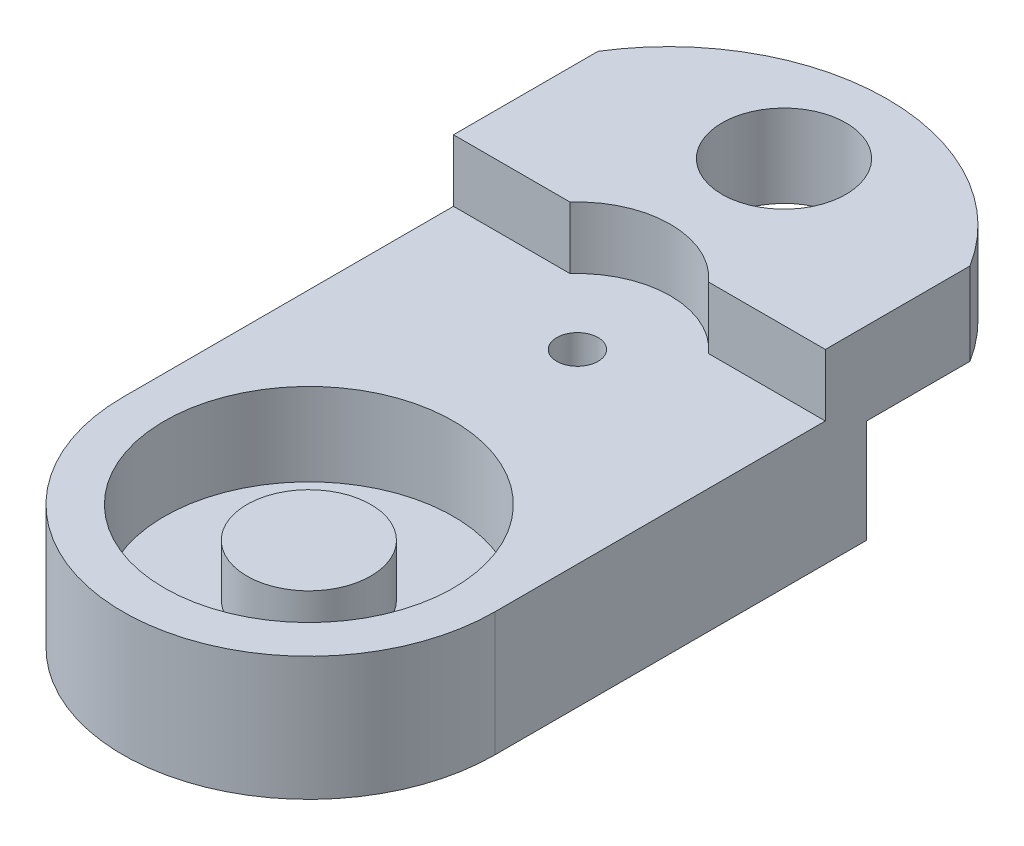
ISO-10303-21;
HEADER;
FILE_DESCRIPTION(('STEP AP214'),'2;1');
FILE_NAME('part.step','',(''),(''),'','','');
FILE_SCHEMA(('AUTOMOTIVE_DESIGN { 1 0 10303 214 1 1 1 1 }'));
ENDSEC;
DATA;
#1=APPLICATION_CONTEXT('core data for automotive mechanical design processes');
#2=APPLICATION_PROTOCOL_DEFINITION('international standard','automotive_design',2000,#1);
#3=PRODUCT_CONTEXT('',#1,'mechanical');
#4=PRODUCT('Part','Part','',(#3));
#5=PRODUCT_RELATED_PRODUCT_CATEGORY('part','',(#4));
#6=PRODUCT_DEFINITION_FORMATION('','',#4);
#7=PRODUCT_DEFINITION_CONTEXT('part definition',#1,'design');
#8=PRODUCT_DEFINITION('design','',#6,#7);
#9=PRODUCT_DEFINITION_SHAPE('','',#8);
#10=(LENGTH_UNIT() NAMED_UNIT(*) SI_UNIT(.MILLI.,.METRE.));
#11=(NAMED_UNIT(*) PLANE_ANGLE_UNIT() SI_UNIT($,.RADIAN.));
#12=(NAMED_UNIT(*) SI_UNIT($,.STERADIAN.) SOLID_ANGLE_UNIT());
#13=UNCERTAINTY_MEASURE_WITH_UNIT(LENGTH_MEASURE(1.E-05),#10,'distance_accuracy_value','');
#14=(GEOMETRIC_REPRESENTATION_CONTEXT(3) GLOBAL_UNCERTAINTY_ASSIGNED_CONTEXT((#13)) GLOBAL_UNIT_ASSIGNED_CONTEXT((#10,
#11,#12)) REPRESENTATION_CONTEXT('',''));
#15=CARTESIAN_POINT('',(0.,0.,0.));
#16=DIRECTION('',(0.,0.,1.));
#17=DIRECTION('',(1.,0.,0.));
#18=AXIS2_PLACEMENT_3D('',#15,#16,#17);
#19=CARTESIAN_POINT('',(-3.,7.,-41.504881108845));
#20=DIRECTION('',(0.,1.,0.));
#21=DIRECTION('',(0.,0.,1.));
#22=AXIS2_PLACEMENT_3D('',#19,#20,#21);
#23=PLANE('',#22);
#24=CARTESIAN_POINT('',(6.,7.,-46.504881108845));
#25=DIRECTION('',(0.,1.,0.));
#26=DIRECTION('',(0.,0.,1.));
#27=AXIS2_PLACEMENT_3D('',#24,#25,#26);
#28=CIRCLE('',#27,3.);
#29=CARTESIAN_POINT('',(6.,7.,-43.504881108845));
#30=VERTEX_POINT('',#29);
#31=EDGE_CURVE('E142',#30,#30,#28,.T.);
#32=ORIENTED_EDGE('',*,*,#31,.T.);
#33=EDGE_LOOP('',(#32));
#34=FACE_BOUND('',#33,.T.);
#35=DIRECTION('',(0.,0.,1.));
#36=VECTOR('',#35,1.);
#37=CARTESIAN_POINT('',(-3.,7.,-41.504881108845));
#38=LINE('',#37,#36);
#39=CARTESIAN_POINT('',(-3.,7.,-46.504881108845));
#40=VERTEX_POINT('',#39);
#41=CARTESIAN_POINT('',(-3.,7.,-41.504881108845));
#42=VERTEX_POINT('',#41);
#43=EDGE_CURVE('E123',#40,#42,#38,.T.);
#44=ORIENTED_EDGE('',*,*,#43,.F.);
#45=CARTESIAN_POINT('',(6.,7.,-40.904881108845));
#46=DIRECTION('',(0.,1.,0.));
#47=DIRECTION('',(0.,0.,1.));
#48=AXIS2_PLACEMENT_3D('',#45,#46,#47);
#49=CIRCLE('',#48,10.6);
#50=CARTESIAN_POINT('',(15.,7.,-46.504881108845));
#51=VERTEX_POINT('',#50);
#52=EDGE_CURVE('E37',#40,#51,#49,.F.);
#53=ORIENTED_EDGE('',*,*,#52,.T.);
#54=DIRECTION('',(0.,0.,1.));
#55=VECTOR('',#54,1.);
#56=CARTESIAN_POINT('',(15.,7.,-41.504881108845));
#57=LINE('',#56,#55);
#58=CARTESIAN_POINT('',(15.,7.,-41.504881108845));
#59=VERTEX_POINT('',#58);
#60=EDGE_CURVE('E124',#51,#59,#57,.T.);
#61=ORIENTED_EDGE('',*,*,#60,.T.);
#62=DIRECTION('',(1.,0.,0.));
#63=VECTOR('',#62,1.);
#64=CARTESIAN_POINT('',(-3.,7.,-41.504881108845));
#65=LINE('',#64,#63);
#66=EDGE_CURVE('E119',#42,#59,#65,.T.);
#67=ORIENTED_EDGE('',*,*,#66,.F.);
#68=EDGE_LOOP('',(#44,#53,#61,#67));
#69=FACE_BOUND('',#68,.T.);
#70=ADVANCED_FACE('F33',(#34,#69),#23,.F.);
#71=CARTESIAN_POINT('',(11.,11.,-39.504881108845));
#72=DIRECTION('',(0.,0.,-1.));
#73=DIRECTION('',(-1.,0.,0.));
#74=AXIS2_PLACEMENT_3D('',#71,#72,#73);
#75=PLANE('',#74);
#76=DIRECTION('',(0.,-1.,0.));
#77=VECTOR('',#76,1.);
#78=CARTESIAN_POINT('',(9.35410196624968,13.,-39.504881108845));
#79=LINE('',#78,#77);
#80=CARTESIAN_POINT('',(9.35410196624968,8.,-39.504881108845));
#81=VERTEX_POINT('',#80);
#82=CARTESIAN_POINT('',(9.35410196624968,11.,-39.504881108845));
#83=VERTEX_POINT('',#82);
#84=EDGE_CURVE('E210',#81,#83,#79,.F.);
#85=ORIENTED_EDGE('',*,*,#84,.F.);
#86=DIRECTION('',(1.,0.,0.));
#87=VECTOR('',#86,1.);
#88=CARTESIAN_POINT('',(11.,8.,-39.504881108845));
#89=LINE('',#88,#87);
#90=CARTESIAN_POINT('',(15.,8.,-39.504881108845));
#91=VERTEX_POINT('',#90);
#92=EDGE_CURVE('E157',#81,#91,#89,.T.);
#93=ORIENTED_EDGE('',*,*,#92,.T.);
#94=DIRECTION('',(0.,-1.,0.));
#95=VECTOR('',#94,1.);
#96=CARTESIAN_POINT('',(15.,11.,-39.504881108845));
#97=LINE('',#96,#95);
#98=CARTESIAN_POINT('',(15.,11.,-39.504881108845));
#99=VERTEX_POINT('',#98);
#100=EDGE_CURVE('E173',#99,#91,#97,.T.);
#101=ORIENTED_EDGE('',*,*,#100,.F.);
#102=DIRECTION('',(1.,0.,0.));
#103=VECTOR('',#102,1.);
#104=CARTESIAN_POINT('',(1.,11.,-39.504881108845));
#105=LINE('',#104,#103);
#106=EDGE_CURVE('E164',#83,#99,#105,.T.);
#107=ORIENTED_EDGE('',*,*,#106,.F.);
#108=EDGE_LOOP('',(#85,#93,#101,#107));
#109=FACE_BOUND('',#108,.T.);
#110=ADVANCED_FACE('F225',(#109),#75,.F.);
#111=DIRECTION('',(0.,-1.,0.));
#112=VECTOR('',#111,1.);
#113=CARTESIAN_POINT('',(2.64589803375032,13.,-39.504881108845));
#114=LINE('',#113,#112);
#115=CARTESIAN_POINT('',(2.64589803375032,11.,-39.504881108845));
#116=VERTEX_POINT('',#115);
#117=CARTESIAN_POINT('',(2.64589803375032,8.,-39.504881108845));
#118=VERTEX_POINT('',#117);
#119=EDGE_CURVE('E208',#116,#118,#114,.T.);
#120=ORIENTED_EDGE('',*,*,#119,.F.);
#121=CARTESIAN_POINT('',(-3.,11.,-39.504881108845));
#122=VERTEX_POINT('',#121);
#123=EDGE_CURVE('E165',#122,#116,#105,.T.);
#124=ORIENTED_EDGE('',*,*,#123,.F.);
#125=DIRECTION('',(0.,-1.,0.));
#126=VECTOR('',#125,1.);
#127=CARTESIAN_POINT('',(-3.,11.,-39.504881108845));
#128=LINE('',#127,#126);
#129=CARTESIAN_POINT('',(-3.,8.,-39.504881108845));
#130=VERTEX_POINT('',#129);
#131=EDGE_CURVE('E176',#122,#130,#128,.T.);
#132=ORIENTED_EDGE('',*,*,#131,.T.);
#133=EDGE_CURVE('E162',#130,#118,#89,.T.);
#134=ORIENTED_EDGE('',*,*,#133,.T.);
#135=EDGE_LOOP('',(#120,#124,#132,#134));
#136=FACE_BOUND('',#135,.T.);
#137=ADVANCED_FACE('F238',(#136),#75,.F.);
#138=CARTESIAN_POINT('',(6.,4.,-23.504881108845));
#139=DIRECTION('',(0.,1.,0.));
#140=DIRECTION('',(0.,0.,1.));
#141=AXIS2_PLACEMENT_3D('',#138,#139,#140);
#142=CYLINDRICAL_SURFACE('',#141,3.);
#143=CARTESIAN_POINT('',(6.,4.,-23.504881108845));
#144=DIRECTION('',(0.,1.,0.));
#145=DIRECTION('',(0.,0.,1.));
#146=AXIS2_PLACEMENT_3D('',#143,#144,#145);
#147=CIRCLE('',#146,3.);
#148=CARTESIAN_POINT('',(6.,4.,-20.504881108845));
#149=VERTEX_POINT('',#148);
#150=EDGE_CURVE('E184',#149,#149,#147,.T.);
#151=ORIENTED_EDGE('',*,*,#150,.T.);
#152=EDGE_LOOP('',(#151));
#153=FACE_BOUND('',#152,.T.);
#154=CARTESIAN_POINT('',(6.,6.5,-23.504881108845));
#155=DIRECTION('',(0.,1.,0.));
#156=DIRECTION('',(0.,0.,1.));
#157=AXIS2_PLACEMENT_3D('',#154,#155,#156);
#158=CIRCLE('',#157,3.);
#159=CARTESIAN_POINT('',(6.,6.5,-20.504881108845));
#160=VERTEX_POINT('',#159);
#161=EDGE_CURVE('E181',#160,#160,#158,.T.);
#162=ORIENTED_EDGE('',*,*,#161,.F.);
#163=EDGE_LOOP('',(#162));
#164=FACE_BOUND('',#163,.T.);
#165=ADVANCED_FACE('F270',(#153,#164),#142,.T.);
#166=CARTESIAN_POINT('',(6.,8.,-23.504881108845));
#167=DIRECTION('',(0.,1.,0.));
#168=DIRECTION('',(0.,0.,1.));
#169=AXIS2_PLACEMENT_3D('',#166,#167,#168);
#170=PLANE('',#169);
#171=ORIENTED_EDGE('',*,*,#92,.F.);
#172=CARTESIAN_POINT('',(6.,8.,-36.504881108845));
#173=DIRECTION('',(0.,1.,0.));
#174=DIRECTION('',(0.,0.,1.));
#175=AXIS2_PLACEMENT_3D('',#172,#173,#174);
#176=CIRCLE('',#175,4.5);
#177=EDGE_CURVE('E145',#81,#118,#176,.T.);
#178=ORIENTED_EDGE('',*,*,#177,.T.);
#179=ORIENTED_EDGE('',*,*,#133,.F.);
#180=DIRECTION('',(0.,0.,1.));
#181=VECTOR('',#180,1.);
#182=CARTESIAN_POINT('',(-3.,8.,-23.504881108845));
#183=LINE('',#182,#181);
#184=CARTESIAN_POINT('',(-3.,8.,-23.504881108845));
#185=VERTEX_POINT('',#184);
#186=EDGE_CURVE('E202',#130,#185,#183,.T.);
#187=ORIENTED_EDGE('',*,*,#186,.T.);
#188=CARTESIAN_POINT('',(6.,8.,-23.504881108845));
#189=DIRECTION('',(0.,1.,0.));
#190=DIRECTION('',(0.,0.,1.));
#191=AXIS2_PLACEMENT_3D('',#188,#189,#190);
#192=CIRCLE('',#191,9.);
#193=CARTESIAN_POINT('',(15.,8.,-23.504881108845));
#194=VERTEX_POINT('',#193);
#195=EDGE_CURVE('E196',#185,#194,#192,.T.);
#196=ORIENTED_EDGE('',*,*,#195,.T.);
#197=DIRECTION('',(0.,0.,-1.));
#198=VECTOR('',#197,1.);
#199=CARTESIAN_POINT('',(15.,8.,-23.504881108845));
#200=LINE('',#199,#198);
#201=EDGE_CURVE('E199',#194,#91,#200,.T.);
#202=ORIENTED_EDGE('',*,*,#201,.T.);
#203=EDGE_LOOP('',(#171,#178,#179,#187,#196,#202));
#204=FACE_BOUND('',#203,.T.);
#205=CARTESIAN_POINT('',(6.,8.,-23.504881108845));
#206=DIRECTION('',(0.,1.,0.));
#207=DIRECTION('',(0.,0.,1.));
#208=AXIS2_PLACEMENT_3D('',#205,#206,#207);
#209=CIRCLE('',#208,7.);
#210=CARTESIAN_POINT('',(6.,8.,-16.504881108845));
#211=VERTEX_POINT('',#210);
#212=EDGE_CURVE('E187',#211,#211,#209,.T.);
#213=ORIENTED_EDGE('',*,*,#212,.F.);
#214=EDGE_LOOP('',(#213));
#215=FACE_BOUND('',#214,.T.);
#216=CARTESIAN_POINT('',(6.,8.,-36.504881108845));
#217=DIRECTION('',(0.,1.,0.));
#218=DIRECTION('',(0.,0.,1.));
#219=AXIS2_PLACEMENT_3D('',#216,#217,#218);
#220=CIRCLE('',#219,1.);
#221=CARTESIAN_POINT('',(6.,8.,-35.504881108845));
#222=VERTEX_POINT('',#221);
#223=EDGE_CURVE('E191',#222,#222,#220,.T.);
#224=ORIENTED_EDGE('',*,*,#223,.F.);
#225=EDGE_LOOP('',(#224));
#226=FACE_BOUND('',#225,.T.);
#227=ADVANCED_FACE('F229',(#204,#215,#226),#170,.T.);
#228=CARTESIAN_POINT('',(6.,8.,-23.504881108845));
#229=DIRECTION('',(0.,-1.,0.));
#230=DIRECTION('',(0.,0.,-1.));
#231=AXIS2_PLACEMENT_3D('',#228,#229,#230);
#232=CYLINDRICAL_SURFACE('',#231,9.);
#233=DIRECTION('',(0.,-1.,0.));
#234=VECTOR('',#233,1.);
#235=CARTESIAN_POINT('',(-3.,8.,-23.504881108845));
#236=LINE('',#235,#234);
#237=CARTESIAN_POINT('',(-3.,2.,-23.504881108845));
#238=VERTEX_POINT('',#237);
#239=EDGE_CURVE('E204',#185,#238,#236,.T.);
#240=ORIENTED_EDGE('',*,*,#239,.T.);
#241=CARTESIAN_POINT('',(6.,2.,-23.504881108845));
#242=DIRECTION('',(0.,1.,0.));
#243=DIRECTION('',(0.,0.,1.));
#244=AXIS2_PLACEMENT_3D('',#241,#242,#243);
#245=CIRCLE('',#244,9.);
#246=CARTESIAN_POINT('',(15.,2.,-23.504881108845));
#247=VERTEX_POINT('',#246);
#248=EDGE_CURVE('E132',#238,#247,#245,.T.);
#249=ORIENTED_EDGE('',*,*,#248,.T.);
#250=DIRECTION('',(0.,-1.,0.));
#251=VECTOR('',#250,1.);
#252=CARTESIAN_POINT('',(15.,8.,-23.504881108845));
#253=LINE('',#252,#251);
#254=EDGE_CURVE('E137',#194,#247,#253,.T.);
#255=ORIENTED_EDGE('',*,*,#254,.F.);
#256=ORIENTED_EDGE('',*,*,#195,.F.);
#257=EDGE_LOOP('',(#240,#249,#255,#256));
#258=FACE_BOUND('',#257,.T.);
#259=ADVANCED_FACE('F35',(#258),#232,.T.);
#260=CARTESIAN_POINT('',(15.,8.,-23.504881108845));
#261=DIRECTION('',(-1.,0.,0.));
#262=DIRECTION('',(0.,0.,1.));
#263=AXIS2_PLACEMENT_3D('',#260,#261,#262);
#264=PLANE('',#263);
#265=ORIENTED_EDGE('',*,*,#254,.T.);
#266=DIRECTION('',(0.,0.,1.));
#267=VECTOR('',#266,1.);
#268=CARTESIAN_POINT('',(15.,2.,-41.504881108845));
#269=LINE('',#268,#267);
#270=CARTESIAN_POINT('',(15.,2.,-41.504881108845));
#271=VERTEX_POINT('',#270);
#272=EDGE_CURVE('E129',#271,#247,#269,.T.);
#273=ORIENTED_EDGE('',*,*,#272,.F.);
#274=DIRECTION('',(0.,-1.,0.));
#275=VECTOR('',#274,1.);
#276=CARTESIAN_POINT('',(15.,7.,-41.504881108845));
#277=LINE('',#276,#275);
#278=EDGE_CURVE('E114',#59,#271,#277,.T.);
#279=ORIENTED_EDGE('',*,*,#278,.F.);
#280=ORIENTED_EDGE('',*,*,#60,.F.);
#281=DIRECTION('',(0.,-1.,0.));
#282=VECTOR('',#281,1.);
#283=CARTESIAN_POINT('',(15.,11.,-46.504881108845));
#284=LINE('',#283,#282);
#285=CARTESIAN_POINT('',(15.,11.,-46.504881108845));
#286=VERTEX_POINT('',#285);
#287=EDGE_CURVE('E57',#286,#51,#284,.T.);
#288=ORIENTED_EDGE('',*,*,#287,.F.);
#289=DIRECTION('',(0.,0.,-1.));
#290=VECTOR('',#289,1.);
#291=CARTESIAN_POINT('',(15.,11.,-39.504881108845));
#292=LINE('',#291,#290);
#293=EDGE_CURVE('E168',#99,#286,#292,.T.);
#294=ORIENTED_EDGE('',*,*,#293,.F.);
#295=ORIENTED_EDGE('',*,*,#100,.T.);
#296=ORIENTED_EDGE('',*,*,#201,.F.);
#297=EDGE_LOOP('',(#265,#273,#279,#280,#288,#294,#295,#296));
#298=FACE_BOUND('',#297,.T.);
#299=ADVANCED_FACE('F135',(#298),#264,.F.);
#300=CARTESIAN_POINT('',(-3.,8.,-23.504881108845));
#301=DIRECTION('',(1.,0.,0.));
#302=DIRECTION('',(0.,0.,-1.));
#303=AXIS2_PLACEMENT_3D('',#300,#301,#302);
#304=PLANE('',#303);
#305=DIRECTION('',(0.,0.,1.));
#306=VECTOR('',#305,1.);
#307=CARTESIAN_POINT('',(-3.,2.,-41.504881108845));
#308=LINE('',#307,#306);
#309=CARTESIAN_POINT('',(-3.,2.,-41.504881108845));
#310=VERTEX_POINT('',#309);
#311=EDGE_CURVE('E131',#310,#238,#308,.T.);
#312=ORIENTED_EDGE('',*,*,#311,.T.);
#313=ORIENTED_EDGE('',*,*,#239,.F.);
#314=ORIENTED_EDGE('',*,*,#186,.F.);
#315=ORIENTED_EDGE('',*,*,#131,.F.);
#316=DIRECTION('',(0.,0.,1.));
#317=VECTOR('',#316,1.);
#318=CARTESIAN_POINT('',(-3.,11.,-39.504881108845));
#319=LINE('',#318,#317);
#320=CARTESIAN_POINT('',(-3.,11.,-46.504881108845));
#321=VERTEX_POINT('',#320);
#322=EDGE_CURVE('E161',#321,#122,#319,.T.);
#323=ORIENTED_EDGE('',*,*,#322,.F.);
#324=DIRECTION('',(0.,-1.,0.));
#325=VECTOR('',#324,1.);
#326=CARTESIAN_POINT('',(-3.,11.,-46.504881108845));
#327=LINE('',#326,#325);
#328=EDGE_CURVE('E179',#321,#40,#327,.T.);
#329=ORIENTED_EDGE('',*,*,#328,.T.);
#330=ORIENTED_EDGE('',*,*,#43,.T.);
#331=DIRECTION('',(0.,-1.,0.));
#332=VECTOR('',#331,1.);
#333=CARTESIAN_POINT('',(-3.,7.,-41.504881108845));
#334=LINE('',#333,#332);
#335=EDGE_CURVE('E49',#42,#310,#334,.T.);
#336=ORIENTED_EDGE('',*,*,#335,.T.);
#337=EDGE_LOOP('',(#312,#313,#314,#315,#323,#329,#330,#336));
#338=FACE_BOUND('',#337,.T.);
#339=ADVANCED_FACE('F234',(#338),#304,.F.);
#340=CARTESIAN_POINT('',(6.,8.,-36.504881108845));
#341=DIRECTION('',(0.,-1.,0.));
#342=DIRECTION('',(0.,0.,-1.));
#343=AXIS2_PLACEMENT_3D('',#340,#341,#342);
#344=CYLINDRICAL_SURFACE('',#343,1.);
#345=CARTESIAN_POINT('',(6.,4.,-36.504881108845));
#346=DIRECTION('',(0.,1.,0.));
#347=DIRECTION('',(0.,0.,1.));
#348=AXIS2_PLACEMENT_3D('',#345,#346,#347);
#349=CIRCLE('',#348,1.);
#350=CARTESIAN_POINT('',(6.,4.,-35.504881108845));
#351=VERTEX_POINT('',#350);
#352=EDGE_CURVE('E11',#351,#351,#349,.T.);
#353=ORIENTED_EDGE('',*,*,#352,.F.);
#354=EDGE_LOOP('',(#353));
#355=FACE_BOUND('',#354,.T.);
#356=ORIENTED_EDGE('',*,*,#223,.T.);
#357=EDGE_LOOP('',(#356));
#358=FACE_BOUND('',#357,.T.);
#359=ADVANCED_FACE('F280',(#355,#358),#344,.F.);
#360=CARTESIAN_POINT('',(6.,4.,-23.504881108845));
#361=DIRECTION('',(0.,1.,0.));
#362=DIRECTION('',(0.,0.,1.));
#363=AXIS2_PLACEMENT_3D('',#360,#361,#362);
#364=CYLINDRICAL_SURFACE('',#363,7.);
#365=CARTESIAN_POINT('',(6.,4.,-23.504881108845));
#366=DIRECTION('',(0.,1.,0.));
#367=DIRECTION('',(0.,0.,1.));
#368=AXIS2_PLACEMENT_3D('',#365,#366,#367);
#369=CIRCLE('',#368,7.);
#370=CARTESIAN_POINT('',(6.,4.,-16.504881108845));
#371=VERTEX_POINT('',#370);
#372=EDGE_CURVE('E188',#371,#371,#369,.T.);
#373=ORIENTED_EDGE('',*,*,#372,.F.);
#374=EDGE_LOOP('',(#373));
#375=FACE_BOUND('',#374,.T.);
#376=ORIENTED_EDGE('',*,*,#212,.T.);
#377=EDGE_LOOP('',(#376));
#378=FACE_BOUND('',#377,.T.);
#379=ADVANCED_FACE('F276',(#375,#378),#364,.F.);
#380=CARTESIAN_POINT('',(6.,4.,-23.504881108845));
#381=DIRECTION('',(0.,1.,0.));
#382=DIRECTION('',(0.,0.,1.));
#383=AXIS2_PLACEMENT_3D('',#380,#381,#382);
#384=PLANE('',#383);
#385=ORIENTED_EDGE('',*,*,#150,.F.);
#386=EDGE_LOOP('',(#385));
#387=FACE_BOUND('',#386,.T.);
#388=ORIENTED_EDGE('',*,*,#372,.T.);
#389=EDGE_LOOP('',(#388));
#390=FACE_BOUND('',#389,.T.);
#391=ADVANCED_FACE('F268',(#387,#390),#384,.T.);
#392=CARTESIAN_POINT('',(6.,6.5,-23.504881108845));
#393=DIRECTION('',(0.,1.,0.));
#394=DIRECTION('',(0.,0.,1.));
#395=AXIS2_PLACEMENT_3D('',#392,#393,#394);
#396=PLANE('',#395);
#397=ORIENTED_EDGE('',*,*,#161,.T.);
#398=EDGE_LOOP('',(#397));
#399=FACE_BOUND('',#398,.T.);
#400=ADVANCED_FACE('F262',(#399),#396,.T.);
#401=CARTESIAN_POINT('',(6.,11.,-40.904881108845));
#402=DIRECTION('',(0.,1.,0.));
#403=DIRECTION('',(0.,0.,1.));
#404=AXIS2_PLACEMENT_3D('',#401,#402,#403);
#405=PLANE('',#404);
#406=ORIENTED_EDGE('',*,*,#123,.T.);
#407=CARTESIAN_POINT('',(6.,11.,-36.504881108845));
#408=DIRECTION('',(0.,1.,0.));
#409=DIRECTION('',(0.,0.,1.));
#410=AXIS2_PLACEMENT_3D('',#407,#408,#409);
#411=CIRCLE('',#410,4.5);
#412=EDGE_CURVE('E147',#116,#83,#411,.F.);
#413=ORIENTED_EDGE('',*,*,#412,.T.);
#414=ORIENTED_EDGE('',*,*,#106,.T.);
#415=ORIENTED_EDGE('',*,*,#293,.T.);
#416=CARTESIAN_POINT('',(6.,11.,-40.904881108845));
#417=DIRECTION('',(0.,1.,0.));
#418=DIRECTION('',(0.,0.,1.));
#419=AXIS2_PLACEMENT_3D('',#416,#417,#418);
#420=CIRCLE('',#419,10.6);
#421=EDGE_CURVE('E158',#286,#321,#420,.T.);
#422=ORIENTED_EDGE('',*,*,#421,.T.);
#423=ORIENTED_EDGE('',*,*,#322,.T.);
#424=EDGE_LOOP('',(#406,#413,#414,#415,#422,#423));
#425=FACE_BOUND('',#424,.T.);
#426=CARTESIAN_POINT('',(6.,11.,-46.504881108845));
#427=DIRECTION('',(0.,1.,0.));
#428=DIRECTION('',(0.,0.,1.));
#429=AXIS2_PLACEMENT_3D('',#426,#427,#428);
#430=CIRCLE('',#429,3.);
#431=CARTESIAN_POINT('',(6.,11.,-43.504881108845));
#432=VERTEX_POINT('',#431);
#433=EDGE_CURVE('E154',#432,#432,#430,.T.);
#434=ORIENTED_EDGE('',*,*,#433,.F.);
#435=EDGE_LOOP('',(#434));
#436=FACE_BOUND('',#435,.T.);
#437=ADVANCED_FACE('F219',(#425,#436),#405,.T.);
#438=CARTESIAN_POINT('',(6.,11.,-40.904881108845));
#439=DIRECTION('',(0.,-1.,0.));
#440=DIRECTION('',(0.,0.,-1.));
#441=AXIS2_PLACEMENT_3D('',#438,#439,#440);
#442=CYLINDRICAL_SURFACE('',#441,10.6);
#443=ORIENTED_EDGE('',*,*,#287,.T.);
#444=ORIENTED_EDGE('',*,*,#52,.F.);
#445=ORIENTED_EDGE('',*,*,#328,.F.);
#446=ORIENTED_EDGE('',*,*,#421,.F.);
#447=EDGE_LOOP('',(#443,#444,#445,#446));
#448=FACE_BOUND('',#447,.T.);
#449=ADVANCED_FACE('F217',(#448),#442,.T.);
#450=CARTESIAN_POINT('',(6.,11.,-46.504881108845));
#451=DIRECTION('',(0.,-1.,0.));
#452=DIRECTION('',(0.,0.,-1.));
#453=AXIS2_PLACEMENT_3D('',#450,#451,#452);
#454=CYLINDRICAL_SURFACE('',#453,3.);
#455=ORIENTED_EDGE('',*,*,#433,.T.);
#456=EDGE_LOOP('',(#455));
#457=FACE_BOUND('',#456,.T.);
#458=ORIENTED_EDGE('',*,*,#31,.F.);
#459=EDGE_LOOP('',(#458));
#460=FACE_BOUND('',#459,.T.);
#461=ADVANCED_FACE('F248',(#457,#460),#454,.F.);
#462=CARTESIAN_POINT('',(-3.,7.,-41.504881108845));
#463=DIRECTION('',(0.,0.,1.));
#464=DIRECTION('',(1.,0.,0.));
#465=AXIS2_PLACEMENT_3D('',#462,#463,#464);
#466=PLANE('',#465);
#467=ORIENTED_EDGE('',*,*,#278,.T.);
#468=DIRECTION('',(1.,0.,0.));
#469=VECTOR('',#468,1.);
#470=CARTESIAN_POINT('',(-3.,2.,-41.504881108845));
#471=LINE('',#470,#469);
#472=EDGE_CURVE('E117',#310,#271,#471,.T.);
#473=ORIENTED_EDGE('',*,*,#472,.F.);
#474=ORIENTED_EDGE('',*,*,#335,.F.);
#475=ORIENTED_EDGE('',*,*,#66,.T.);
#476=EDGE_LOOP('',(#467,#473,#474,#475));
#477=FACE_BOUND('',#476,.T.);
#478=ADVANCED_FACE('F116',(#477),#466,.F.);
#479=CARTESIAN_POINT('',(6.,13.,-36.504881108845));
#480=DIRECTION('',(0.,-1.,0.));
#481=DIRECTION('',(0.,0.,-1.));
#482=AXIS2_PLACEMENT_3D('',#479,#480,#481);
#483=CYLINDRICAL_SURFACE('',#482,4.5);
#484=ORIENTED_EDGE('',*,*,#84,.T.);
#485=ORIENTED_EDGE('',*,*,#412,.F.);
#486=ORIENTED_EDGE('',*,*,#119,.T.);
#487=ORIENTED_EDGE('',*,*,#177,.F.);
#488=EDGE_LOOP('',(#484,#485,#486,#487));
#489=FACE_BOUND('',#488,.T.);
#490=ADVANCED_FACE('F239',(#489),#483,.F.);
#491=CARTESIAN_POINT('',(-3.,2.,-41.504881108845));
#492=DIRECTION('',(0.,1.,0.));
#493=DIRECTION('',(0.,0.,1.));
#494=AXIS2_PLACEMENT_3D('',#491,#492,#493);
#495=PLANE('',#494);
#496=ORIENTED_EDGE('',*,*,#248,.F.);
#497=ORIENTED_EDGE('',*,*,#311,.F.);
#498=ORIENTED_EDGE('',*,*,#472,.T.);
#499=ORIENTED_EDGE('',*,*,#272,.T.);
#500=EDGE_LOOP('',(#496,#497,#498,#499));
#501=FACE_BOUND('',#500,.T.);
#502=ADVANCED_FACE('F128',(#501),#495,.F.);
#503=CARTESIAN_POINT('',(-3.,4.,-41.504881108845));
#504=DIRECTION('',(0.,1.,0.));
#505=DIRECTION('',(0.,0.,1.));
#506=AXIS2_PLACEMENT_3D('',#503,#504,#505);
#507=PLANE('',#506);
#508=ORIENTED_EDGE('',*,*,#352,.T.);
#509=EDGE_LOOP('',(#508));
#510=FACE_BOUND('',#509,.T.);
#511=ADVANCED_FACE('F246',(#510),#507,.T.);
#512=CLOSED_SHELL('',(#70,#110,#137,#165,#227,#259,#299,#339,#359,#379,#391,#400,#437,#449,#461,
#478,#490,#502,#511));
#513=MANIFOLD_SOLID_BREP('B2',#512);
#514=ADVANCED_BREP_SHAPE_REPRESENTATION('',(#18,#513),#14);
#515=SHAPE_DEFINITION_REPRESENTATION(#9,#514);
ENDSEC;
END-ISO-10303-21;
